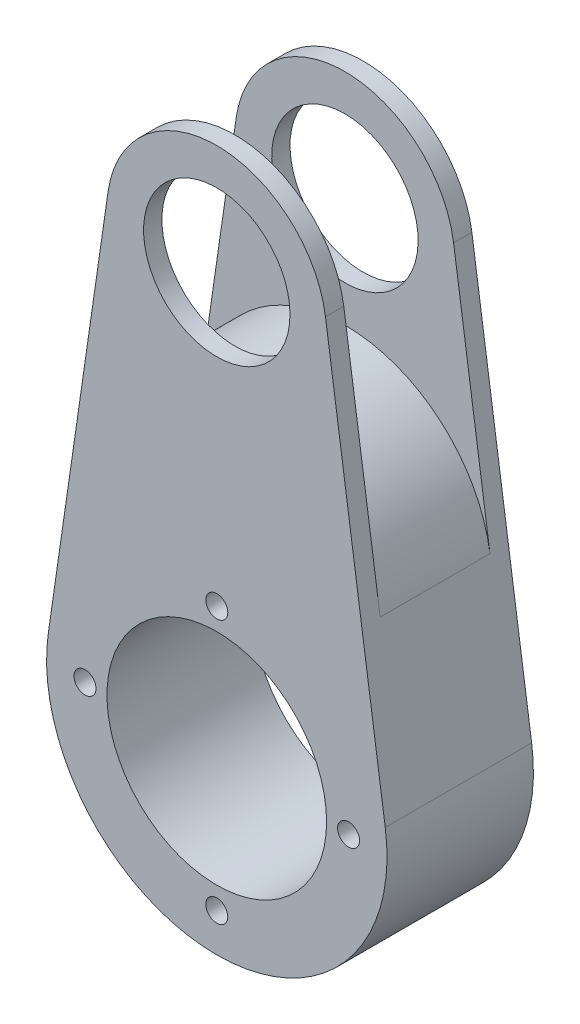
ISO-10303-21;
HEADER;
FILE_DESCRIPTION(('STEP AP214'),'2;1');
FILE_NAME('part.step','',(''),(''),'','','');
FILE_SCHEMA(('AUTOMOTIVE_DESIGN { 1 0 10303 214 1 1 1 1 }'));
ENDSEC;
DATA;
#1=APPLICATION_CONTEXT('core data for automotive mechanical design processes');
#2=APPLICATION_PROTOCOL_DEFINITION('international standard','automotive_design',2000,#1);
#3=PRODUCT_CONTEXT('',#1,'mechanical');
#4=PRODUCT('Part','Part','',(#3));
#5=PRODUCT_RELATED_PRODUCT_CATEGORY('part','',(#4));
#6=PRODUCT_DEFINITION_FORMATION('','',#4);
#7=PRODUCT_DEFINITION_CONTEXT('part definition',#1,'design');
#8=PRODUCT_DEFINITION('design','',#6,#7);
#9=PRODUCT_DEFINITION_SHAPE('','',#8);
#10=(LENGTH_UNIT() NAMED_UNIT(*) SI_UNIT(.MILLI.,.METRE.));
#11=(NAMED_UNIT(*) PLANE_ANGLE_UNIT() SI_UNIT($,.RADIAN.));
#12=(NAMED_UNIT(*) SI_UNIT($,.STERADIAN.) SOLID_ANGLE_UNIT());
#13=UNCERTAINTY_MEASURE_WITH_UNIT(LENGTH_MEASURE(1.E-05),#10,'distance_accuracy_value','');
#14=(GEOMETRIC_REPRESENTATION_CONTEXT(3) GLOBAL_UNCERTAINTY_ASSIGNED_CONTEXT((#13)) GLOBAL_UNIT_ASSIGNED_CONTEXT((#10,
#11,#12)) REPRESENTATION_CONTEXT('',''));
#15=CARTESIAN_POINT('',(0.,0.,0.));
#16=DIRECTION('',(0.,0.,1.));
#17=DIRECTION('',(1.,0.,0.));
#18=AXIS2_PLACEMENT_3D('',#15,#16,#17);
#19=CARTESIAN_POINT('',(0.,58.1620294068383,10.));
#20=DIRECTION('',(0.,0.,-1.));
#21=DIRECTION('',(-1.,0.,0.));
#22=AXIS2_PLACEMENT_3D('',#19,#20,#21);
#23=CYLINDRICAL_SURFACE('',#22,15.);
#24=DIRECTION('',(0.,0.,-1.));
#25=VECTOR('',#24,1.);
#26=CARTESIAN_POINT('',(-14.8448020346523,60.3142033198817,10.));
#27=LINE('',#26,#25);
#28=CARTESIAN_POINT('',(-14.8448020346523,60.3142033198817,-7.49999999999999));
#29=VERTEX_POINT('',#28);
#30=CARTESIAN_POINT('',(-14.8448020346523,60.3142033198817,-10.));
#31=VERTEX_POINT('',#30);
#32=EDGE_CURVE('E138',#29,#31,#27,.T.);
#33=ORIENTED_EDGE('',*,*,#32,.F.);
#34=CARTESIAN_POINT('',(0.,58.1620294068383,-7.49999999999999));
#35=DIRECTION('',(0.,0.,-1.));
#36=DIRECTION('',(0.,1.,0.));
#37=AXIS2_PLACEMENT_3D('',#34,#35,#36);
#38=CIRCLE('',#37,15.);
#39=CARTESIAN_POINT('',(14.8448020346522,60.3142033198817,-7.49999999999999));
#40=VERTEX_POINT('',#39);
#41=EDGE_CURVE('E181',#29,#40,#38,.T.);
#42=ORIENTED_EDGE('',*,*,#41,.T.);
#43=DIRECTION('',(0.,0.,-1.));
#44=VECTOR('',#43,1.);
#45=CARTESIAN_POINT('',(14.8448020346522,60.3142033198817,10.));
#46=LINE('',#45,#44);
#47=CARTESIAN_POINT('',(14.8448020346522,60.3142033198817,-10.));
#48=VERTEX_POINT('',#47);
#49=EDGE_CURVE('E137',#40,#48,#46,.T.);
#50=ORIENTED_EDGE('',*,*,#49,.T.);
#51=CARTESIAN_POINT('',(0.,58.1620294068383,-10.));
#52=DIRECTION('',(0.,0.,1.));
#53=DIRECTION('',(1.,0.,0.));
#54=AXIS2_PLACEMENT_3D('',#51,#52,#53);
#55=CIRCLE('',#54,15.);
#56=EDGE_CURVE('E187',#48,#31,#55,.T.);
#57=ORIENTED_EDGE('',*,*,#56,.T.);
#58=EDGE_LOOP('',(#33,#42,#50,#57));
#59=FACE_BOUND('',#58,.T.);
#60=ADVANCED_FACE('F39',(#59),#23,.T.);
#61=CARTESIAN_POINT('',(0.,58.1620294068383,10.));
#62=DIRECTION('',(0.,0.,-1.));
#63=DIRECTION('',(-1.,0.,0.));
#64=AXIS2_PLACEMENT_3D('',#61,#62,#63);
#65=CYLINDRICAL_SURFACE('',#64,10.);
#66=CARTESIAN_POINT('',(0.,58.1620294068383,-7.49999999999999));
#67=DIRECTION('',(0.,0.,-1.));
#68=DIRECTION('',(0.,1.,0.));
#69=AXIS2_PLACEMENT_3D('',#66,#67,#68);
#70=CIRCLE('',#69,10.);
#71=CARTESIAN_POINT('',(0.,68.1620294068383,-7.49999999999999));
#72=VERTEX_POINT('',#71);
#73=EDGE_CURVE('E152',#72,#72,#70,.T.);
#74=ORIENTED_EDGE('',*,*,#73,.F.);
#75=EDGE_LOOP('',(#74));
#76=FACE_BOUND('',#75,.T.);
#77=CARTESIAN_POINT('',(0.,58.1620294068383,-10.));
#78=DIRECTION('',(0.,0.,1.));
#79=DIRECTION('',(1.,0.,0.));
#80=AXIS2_PLACEMENT_3D('',#77,#78,#79);
#81=CIRCLE('',#80,10.);
#82=CARTESIAN_POINT('',(9.99999999999995,58.1620294068383,-10.));
#83=VERTEX_POINT('',#82);
#84=EDGE_CURVE('E218',#83,#83,#81,.T.);
#85=ORIENTED_EDGE('',*,*,#84,.F.);
#86=EDGE_LOOP('',(#85));
#87=FACE_BOUND('',#86,.T.);
#88=ADVANCED_FACE('F265',(#76,#87),#65,.F.);
#89=CARTESIAN_POINT('',(0.,0.662029406838254,10.));
#90=DIRECTION('',(0.,0.,1.));
#91=DIRECTION('',(1.,0.,0.));
#92=AXIS2_PLACEMENT_3D('',#89,#90,#91);
#93=PLANE('',#92);
#94=CARTESIAN_POINT('',(0.,-17.3379705931617,10.));
#95=DIRECTION('',(0.,0.,1.));
#96=DIRECTION('',(1.,0.,0.));
#97=AXIS2_PLACEMENT_3D('',#94,#95,#96);
#98=CIRCLE('',#97,1.5);
#99=CARTESIAN_POINT('',(1.49999999999995,-17.3379705931617,10.));
#100=VERTEX_POINT('',#99);
#101=EDGE_CURVE('E233',#100,#100,#98,.T.);
#102=ORIENTED_EDGE('',*,*,#101,.F.);
#103=EDGE_LOOP('',(#102));
#104=FACE_BOUND('',#103,.T.);
#105=CARTESIAN_POINT('',(0.,18.6620294068382,10.));
#106=DIRECTION('',(0.,0.,1.));
#107=DIRECTION('',(1.,0.,0.));
#108=AXIS2_PLACEMENT_3D('',#105,#106,#107);
#109=CIRCLE('',#108,1.5);
#110=CARTESIAN_POINT('',(1.49999999999994,18.6620294068382,10.));
#111=VERTEX_POINT('',#110);
#112=EDGE_CURVE('E221',#111,#111,#109,.T.);
#113=ORIENTED_EDGE('',*,*,#112,.F.);
#114=EDGE_LOOP('',(#113));
#115=FACE_BOUND('',#114,.T.);
#116=CARTESIAN_POINT('',(0.,0.662029406838254,10.));
#117=DIRECTION('',(0.,0.,1.));
#118=DIRECTION('',(1.,0.,0.));
#119=AXIS2_PLACEMENT_3D('',#116,#117,#118);
#120=CIRCLE('',#119,15.);
#121=CARTESIAN_POINT('',(14.9999999999999,0.662029406838254,10.));
#122=VERTEX_POINT('',#121);
#123=EDGE_CURVE('E207',#122,#122,#120,.T.);
#124=ORIENTED_EDGE('',*,*,#123,.F.);
#125=EDGE_LOOP('',(#124));
#126=FACE_BOUND('',#125,.T.);
#127=CARTESIAN_POINT('',(0.,0.662029406838254,10.));
#128=DIRECTION('',(0.,0.,1.));
#129=DIRECTION('',(1.,0.,0.));
#130=AXIS2_PLACEMENT_3D('',#127,#128,#129);
#131=CIRCLE('',#130,23.25);
#132=CARTESIAN_POINT('',(-23.009443153711,3.99789897205565,10.));
#133=VERTEX_POINT('',#132);
#134=CARTESIAN_POINT('',(23.0094431537109,3.99789897205565,10.));
#135=VERTEX_POINT('',#134);
#136=EDGE_CURVE('E200',#133,#135,#131,.T.);
#137=ORIENTED_EDGE('',*,*,#136,.T.);
#138=DIRECTION('',(-0.143478260869565,0.989653468976816,0.));
#139=VECTOR('',#138,1.);
#140=CARTESIAN_POINT('',(23.0094431537109,3.99789897205565,10.));
#141=LINE('',#140,#139);
#142=CARTESIAN_POINT('',(14.8448020346522,60.3142033198817,10.));
#143=VERTEX_POINT('',#142);
#144=EDGE_CURVE('E202',#135,#143,#141,.T.);
#145=ORIENTED_EDGE('',*,*,#144,.T.);
#146=CARTESIAN_POINT('',(0.,58.1620294068383,10.));
#147=DIRECTION('',(0.,0.,1.));
#148=DIRECTION('',(1.,0.,0.));
#149=AXIS2_PLACEMENT_3D('',#146,#147,#148);
#150=CIRCLE('',#149,15.);
#151=CARTESIAN_POINT('',(-14.8448020346523,60.3142033198817,10.));
#152=VERTEX_POINT('',#151);
#153=EDGE_CURVE('E209',#143,#152,#150,.T.);
#154=ORIENTED_EDGE('',*,*,#153,.T.);
#155=DIRECTION('',(-0.143478260869565,-0.989653468976816,0.));
#156=VECTOR('',#155,1.);
#157=CARTESIAN_POINT('',(-23.009443153711,3.99789897205565,10.));
#158=LINE('',#157,#156);
#159=EDGE_CURVE('E136',#152,#133,#158,.T.);
#160=ORIENTED_EDGE('',*,*,#159,.T.);
#161=EDGE_LOOP('',(#137,#145,#154,#160));
#162=FACE_BOUND('',#161,.T.);
#163=CARTESIAN_POINT('',(0.,58.1620294068383,10.));
#164=DIRECTION('',(0.,0.,1.));
#165=DIRECTION('',(1.,0.,0.));
#166=AXIS2_PLACEMENT_3D('',#163,#164,#165);
#167=CIRCLE('',#166,10.);
#168=CARTESIAN_POINT('',(9.99999999999995,58.1620294068383,10.));
#169=VERTEX_POINT('',#168);
#170=EDGE_CURVE('E215',#169,#169,#167,.T.);
#171=ORIENTED_EDGE('',*,*,#170,.F.);
#172=EDGE_LOOP('',(#171));
#173=FACE_BOUND('',#172,.T.);
#174=CARTESIAN_POINT('',(17.9999999999999,0.662029406838253,10.));
#175=DIRECTION('',(0.,0.,1.));
#176=DIRECTION('',(1.,0.,0.));
#177=AXIS2_PLACEMENT_3D('',#174,#175,#176);
#178=CIRCLE('',#177,1.5);
#179=CARTESIAN_POINT('',(19.4999999999999,0.662029406838253,10.));
#180=VERTEX_POINT('',#179);
#181=EDGE_CURVE('E227',#180,#180,#178,.T.);
#182=ORIENTED_EDGE('',*,*,#181,.F.);
#183=EDGE_LOOP('',(#182));
#184=FACE_BOUND('',#183,.T.);
#185=CARTESIAN_POINT('',(-18.,0.662029406838253,10.));
#186=DIRECTION('',(0.,0.,1.));
#187=DIRECTION('',(1.,0.,0.));
#188=AXIS2_PLACEMENT_3D('',#185,#186,#187);
#189=CIRCLE('',#188,1.5);
#190=CARTESIAN_POINT('',(-16.5,0.662029406838253,10.));
#191=VERTEX_POINT('',#190);
#192=EDGE_CURVE('E239',#191,#191,#189,.T.);
#193=ORIENTED_EDGE('',*,*,#192,.F.);
#194=EDGE_LOOP('',(#193));
#195=FACE_BOUND('',#194,.T.);
#196=ADVANCED_FACE('F262',(#104,#115,#126,#162,#173,#184,#195),#93,.T.);
#197=CARTESIAN_POINT('',(0.,0.662029406838254,-10.));
#198=DIRECTION('',(0.,0.,1.));
#199=DIRECTION('',(1.,0.,0.));
#200=AXIS2_PLACEMENT_3D('',#197,#198,#199);
#201=PLANE('',#200);
#202=CARTESIAN_POINT('',(0.,0.662029406838254,-10.));
#203=DIRECTION('',(0.,0.,1.));
#204=DIRECTION('',(1.,0.,0.));
#205=AXIS2_PLACEMENT_3D('',#202,#203,#204);
#206=CIRCLE('',#205,23.25);
#207=CARTESIAN_POINT('',(-23.009443153711,3.99789897205565,-10.));
#208=VERTEX_POINT('',#207);
#209=CARTESIAN_POINT('',(23.0094431537109,3.99789897205565,-10.));
#210=VERTEX_POINT('',#209);
#211=EDGE_CURVE('E198',#208,#210,#206,.T.);
#212=ORIENTED_EDGE('',*,*,#211,.F.);
#213=DIRECTION('',(-0.143478260869565,-0.989653468976816,0.));
#214=VECTOR('',#213,1.);
#215=CARTESIAN_POINT('',(-23.009443153711,3.99789897205565,-10.));
#216=LINE('',#215,#214);
#217=EDGE_CURVE('E191',#31,#208,#216,.T.);
#218=ORIENTED_EDGE('',*,*,#217,.F.);
#219=ORIENTED_EDGE('',*,*,#56,.F.);
#220=DIRECTION('',(-0.143478260869565,0.989653468976816,0.));
#221=VECTOR('',#220,1.);
#222=CARTESIAN_POINT('',(23.0094431537109,3.99789897205565,-10.));
#223=LINE('',#222,#221);
#224=EDGE_CURVE('E192',#210,#48,#223,.T.);
#225=ORIENTED_EDGE('',*,*,#224,.F.);
#226=EDGE_LOOP('',(#212,#218,#219,#225));
#227=FACE_BOUND('',#226,.T.);
#228=CARTESIAN_POINT('',(0.,0.662029406838254,-10.));
#229=DIRECTION('',(0.,0.,1.));
#230=DIRECTION('',(1.,0.,0.));
#231=AXIS2_PLACEMENT_3D('',#228,#229,#230);
#232=CIRCLE('',#231,15.);
#233=CARTESIAN_POINT('',(14.9999999999999,0.662029406838254,-10.));
#234=VERTEX_POINT('',#233);
#235=EDGE_CURVE('E212',#234,#234,#232,.T.);
#236=ORIENTED_EDGE('',*,*,#235,.T.);
#237=EDGE_LOOP('',(#236));
#238=FACE_BOUND('',#237,.T.);
#239=ORIENTED_EDGE('',*,*,#84,.T.);
#240=EDGE_LOOP('',(#239));
#241=FACE_BOUND('',#240,.T.);
#242=CARTESIAN_POINT('',(0.,18.6620294068382,-10.));
#243=DIRECTION('',(0.,0.,1.));
#244=DIRECTION('',(1.,0.,0.));
#245=AXIS2_PLACEMENT_3D('',#242,#243,#244);
#246=CIRCLE('',#245,1.5);
#247=CARTESIAN_POINT('',(1.49999999999994,18.6620294068382,-10.));
#248=VERTEX_POINT('',#247);
#249=EDGE_CURVE('E224',#248,#248,#246,.T.);
#250=ORIENTED_EDGE('',*,*,#249,.T.);
#251=EDGE_LOOP('',(#250));
#252=FACE_BOUND('',#251,.T.);
#253=CARTESIAN_POINT('',(17.9999999999999,0.662029406838253,-10.));
#254=DIRECTION('',(0.,0.,1.));
#255=DIRECTION('',(1.,0.,0.));
#256=AXIS2_PLACEMENT_3D('',#253,#254,#255);
#257=CIRCLE('',#256,1.5);
#258=CARTESIAN_POINT('',(19.4999999999999,0.662029406838253,-10.));
#259=VERTEX_POINT('',#258);
#260=EDGE_CURVE('E230',#259,#259,#257,.T.);
#261=ORIENTED_EDGE('',*,*,#260,.T.);
#262=EDGE_LOOP('',(#261));
#263=FACE_BOUND('',#262,.T.);
#264=CARTESIAN_POINT('',(0.,-17.3379705931617,-10.));
#265=DIRECTION('',(0.,0.,1.));
#266=DIRECTION('',(1.,0.,0.));
#267=AXIS2_PLACEMENT_3D('',#264,#265,#266);
#268=CIRCLE('',#267,1.5);
#269=CARTESIAN_POINT('',(1.49999999999995,-17.3379705931617,-10.));
#270=VERTEX_POINT('',#269);
#271=EDGE_CURVE('E236',#270,#270,#268,.T.);
#272=ORIENTED_EDGE('',*,*,#271,.T.);
#273=EDGE_LOOP('',(#272));
#274=FACE_BOUND('',#273,.T.);
#275=CARTESIAN_POINT('',(-18.,0.662029406838253,-10.));
#276=DIRECTION('',(0.,0.,1.));
#277=DIRECTION('',(1.,0.,0.));
#278=AXIS2_PLACEMENT_3D('',#275,#276,#277);
#279=CIRCLE('',#278,1.5);
#280=CARTESIAN_POINT('',(-16.5,0.662029406838253,-10.));
#281=VERTEX_POINT('',#280);
#282=EDGE_CURVE('E242',#281,#281,#279,.T.);
#283=ORIENTED_EDGE('',*,*,#282,.T.);
#284=EDGE_LOOP('',(#283));
#285=FACE_BOUND('',#284,.T.);
#286=ADVANCED_FACE('F195',(#227,#238,#241,#252,#263,#274,#285),#201,.F.);
#287=CARTESIAN_POINT('',(0.,0.662029406838254,10.));
#288=DIRECTION('',(0.,0.,-1.));
#289=DIRECTION('',(-1.,0.,0.));
#290=AXIS2_PLACEMENT_3D('',#287,#288,#289);
#291=CYLINDRICAL_SURFACE('',#290,23.25);
#292=ORIENTED_EDGE('',*,*,#211,.T.);
#293=DIRECTION('',(0.,0.,-1.));
#294=VECTOR('',#293,1.);
#295=CARTESIAN_POINT('',(23.0094431537109,3.99789897205565,10.));
#296=LINE('',#295,#294);
#297=EDGE_CURVE('E145',#135,#210,#296,.T.);
#298=ORIENTED_EDGE('',*,*,#297,.F.);
#299=ORIENTED_EDGE('',*,*,#136,.F.);
#300=DIRECTION('',(0.,0.,-1.));
#301=VECTOR('',#300,1.);
#302=CARTESIAN_POINT('',(-23.009443153711,3.99789897205565,10.));
#303=LINE('',#302,#301);
#304=EDGE_CURVE('E141',#133,#208,#303,.T.);
#305=ORIENTED_EDGE('',*,*,#304,.T.);
#306=EDGE_LOOP('',(#292,#298,#299,#305));
#307=FACE_BOUND('',#306,.T.);
#308=ADVANCED_FACE('F260',(#307),#291,.T.);
#309=CARTESIAN_POINT('',(23.0094431537109,3.99789897205565,10.));
#310=DIRECTION('',(-0.989653468976816,-0.143478260869565,0.));
#311=DIRECTION('',(0.143478260869565,-0.989653468976816,0.));
#312=AXIS2_PLACEMENT_3D('',#309,#310,#311);
#313=PLANE('',#312);
#314=DIRECTION('',(0.,0.,1.));
#315=VECTOR('',#314,1.);
#316=CARTESIAN_POINT('',(19.8150357860778,26.0315946242296,10.));
#317=LINE('',#316,#315);
#318=CARTESIAN_POINT('',(19.8150357860778,26.0315946242296,-7.5));
#319=VERTEX_POINT('',#318);
#320=CARTESIAN_POINT('',(19.8150357860778,26.0315946242296,7.5));
#321=VERTEX_POINT('',#320);
#322=EDGE_CURVE('E148',#319,#321,#317,.T.);
#323=ORIENTED_EDGE('',*,*,#322,.T.);
#324=DIRECTION('',(-0.143478260869565,0.989653468976816,0.));
#325=VECTOR('',#324,1.);
#326=CARTESIAN_POINT('',(23.0094431537109,3.99789897205565,7.5));
#327=LINE('',#326,#325);
#328=CARTESIAN_POINT('',(14.8448020346522,60.3142033198817,7.5));
#329=VERTEX_POINT('',#328);
#330=EDGE_CURVE('E126',#321,#329,#327,.T.);
#331=ORIENTED_EDGE('',*,*,#330,.T.);
#332=EDGE_CURVE('E123',#143,#329,#46,.T.);
#333=ORIENTED_EDGE('',*,*,#332,.F.);
#334=ORIENTED_EDGE('',*,*,#144,.F.);
#335=ORIENTED_EDGE('',*,*,#297,.T.);
#336=ORIENTED_EDGE('',*,*,#224,.T.);
#337=ORIENTED_EDGE('',*,*,#49,.F.);
#338=DIRECTION('',(0.143478260869565,-0.989653468976816,0.));
#339=VECTOR('',#338,1.);
#340=CARTESIAN_POINT('',(23.0094431537109,3.99789897205565,-7.5));
#341=LINE('',#340,#339);
#342=EDGE_CURVE('E245',#40,#319,#341,.T.);
#343=ORIENTED_EDGE('',*,*,#342,.T.);
#344=EDGE_LOOP('',(#323,#331,#333,#334,#335,#336,#337,#343));
#345=FACE_BOUND('',#344,.T.);
#346=ADVANCED_FACE('F256',(#345),#313,.F.);
#347=CARTESIAN_POINT('',(0.,58.1620294068383,7.5));
#348=DIRECTION('',(0.,0.,1.));
#349=DIRECTION('',(1.,0.,0.));
#350=AXIS2_PLACEMENT_3D('',#347,#348,#349);
#351=CIRCLE('',#350,15.);
#352=CARTESIAN_POINT('',(-14.8448020346523,60.3142033198817,7.5));
#353=VERTEX_POINT('',#352);
#354=EDGE_CURVE('E117',#329,#353,#351,.T.);
#355=ORIENTED_EDGE('',*,*,#354,.T.);
#356=EDGE_CURVE('E120',#152,#353,#27,.T.);
#357=ORIENTED_EDGE('',*,*,#356,.F.);
#358=ORIENTED_EDGE('',*,*,#153,.F.);
#359=ORIENTED_EDGE('',*,*,#332,.T.);
#360=EDGE_LOOP('',(#355,#357,#358,#359));
#361=FACE_BOUND('',#360,.T.);
#362=ADVANCED_FACE('F118',(#361),#23,.T.);
#363=CARTESIAN_POINT('',(-23.009443153711,3.99789897205565,10.));
#364=DIRECTION('',(0.989653468976816,-0.143478260869565,0.));
#365=DIRECTION('',(0.143478260869565,0.989653468976816,0.));
#366=AXIS2_PLACEMENT_3D('',#363,#364,#365);
#367=PLANE('',#366);
#368=DIRECTION('',(0.,0.,-1.));
#369=VECTOR('',#368,1.);
#370=CARTESIAN_POINT('',(-19.8150357860779,26.0315946242296,10.));
#371=LINE('',#370,#369);
#372=CARTESIAN_POINT('',(-19.8150357860779,26.0315946242296,7.5));
#373=VERTEX_POINT('',#372);
#374=CARTESIAN_POINT('',(-19.8150357860779,26.0315946242296,-7.5));
#375=VERTEX_POINT('',#374);
#376=EDGE_CURVE('E161',#373,#375,#371,.T.);
#377=ORIENTED_EDGE('',*,*,#376,.T.);
#378=DIRECTION('',(0.143478260869565,0.989653468976816,0.));
#379=VECTOR('',#378,1.);
#380=CARTESIAN_POINT('',(-23.009443153711,3.99789897205565,-7.5));
#381=LINE('',#380,#379);
#382=EDGE_CURVE('E54',#375,#29,#381,.T.);
#383=ORIENTED_EDGE('',*,*,#382,.T.);
#384=ORIENTED_EDGE('',*,*,#32,.T.);
#385=ORIENTED_EDGE('',*,*,#217,.T.);
#386=ORIENTED_EDGE('',*,*,#304,.F.);
#387=ORIENTED_EDGE('',*,*,#159,.F.);
#388=ORIENTED_EDGE('',*,*,#356,.T.);
#389=DIRECTION('',(-0.143478260869565,-0.989653468976816,0.));
#390=VECTOR('',#389,1.);
#391=CARTESIAN_POINT('',(-23.009443153711,3.99789897205565,7.5));
#392=LINE('',#391,#390);
#393=EDGE_CURVE('E62',#353,#373,#392,.T.);
#394=ORIENTED_EDGE('',*,*,#393,.T.);
#395=EDGE_LOOP('',(#377,#383,#384,#385,#386,#387,#388,#394));
#396=FACE_BOUND('',#395,.T.);
#397=ADVANCED_FACE('F134',(#396),#367,.F.);
#398=CARTESIAN_POINT('',(0.,0.662029406838254,10.));
#399=DIRECTION('',(0.,0.,-1.));
#400=DIRECTION('',(-1.,0.,0.));
#401=AXIS2_PLACEMENT_3D('',#398,#399,#400);
#402=CYLINDRICAL_SURFACE('',#401,15.);
#403=ORIENTED_EDGE('',*,*,#123,.T.);
#404=EDGE_LOOP('',(#403));
#405=FACE_BOUND('',#404,.T.);
#406=ORIENTED_EDGE('',*,*,#235,.F.);
#407=EDGE_LOOP('',(#406));
#408=FACE_BOUND('',#407,.T.);
#409=ADVANCED_FACE('F302',(#405,#408),#402,.F.);
#410=CARTESIAN_POINT('',(0.,58.1620294068383,7.5));
#411=DIRECTION('',(0.,0.,1.));
#412=DIRECTION('',(1.,0.,0.));
#413=AXIS2_PLACEMENT_3D('',#410,#411,#412);
#414=CIRCLE('',#413,10.);
#415=CARTESIAN_POINT('',(9.99999999999995,58.1620294068383,7.5));
#416=VERTEX_POINT('',#415);
#417=EDGE_CURVE('E132',#416,#416,#414,.T.);
#418=ORIENTED_EDGE('',*,*,#417,.F.);
#419=EDGE_LOOP('',(#418));
#420=FACE_BOUND('',#419,.T.);
#421=ORIENTED_EDGE('',*,*,#170,.T.);
#422=EDGE_LOOP('',(#421));
#423=FACE_BOUND('',#422,.T.);
#424=ADVANCED_FACE('F295',(#420,#423),#65,.F.);
#425=CARTESIAN_POINT('',(0.,18.6620294068382,10.));
#426=DIRECTION('',(0.,0.,-1.));
#427=DIRECTION('',(-1.,0.,0.));
#428=AXIS2_PLACEMENT_3D('',#425,#426,#427);
#429=CYLINDRICAL_SURFACE('',#428,1.5);
#430=ORIENTED_EDGE('',*,*,#112,.T.);
#431=EDGE_LOOP('',(#430));
#432=FACE_BOUND('',#431,.T.);
#433=ORIENTED_EDGE('',*,*,#249,.F.);
#434=EDGE_LOOP('',(#433));
#435=FACE_BOUND('',#434,.T.);
#436=ADVANCED_FACE('F326',(#432,#435),#429,.F.);
#437=CARTESIAN_POINT('',(17.9999999999999,0.662029406838253,10.));
#438=DIRECTION('',(0.,0.,-1.));
#439=DIRECTION('',(-1.,0.,0.));
#440=AXIS2_PLACEMENT_3D('',#437,#438,#439);
#441=CYLINDRICAL_SURFACE('',#440,1.5);
#442=ORIENTED_EDGE('',*,*,#181,.T.);
#443=EDGE_LOOP('',(#442));
#444=FACE_BOUND('',#443,.T.);
#445=ORIENTED_EDGE('',*,*,#260,.F.);
#446=EDGE_LOOP('',(#445));
#447=FACE_BOUND('',#446,.T.);
#448=ADVANCED_FACE('F322',(#444,#447),#441,.F.);
#449=CARTESIAN_POINT('',(0.,-17.3379705931617,10.));
#450=DIRECTION('',(0.,0.,-1.));
#451=DIRECTION('',(-1.,0.,0.));
#452=AXIS2_PLACEMENT_3D('',#449,#450,#451);
#453=CYLINDRICAL_SURFACE('',#452,1.5);
#454=ORIENTED_EDGE('',*,*,#101,.T.);
#455=EDGE_LOOP('',(#454));
#456=FACE_BOUND('',#455,.T.);
#457=ORIENTED_EDGE('',*,*,#271,.F.);
#458=EDGE_LOOP('',(#457));
#459=FACE_BOUND('',#458,.T.);
#460=ADVANCED_FACE('F277',(#456,#459),#453,.F.);
#461=CARTESIAN_POINT('',(-18.,0.662029406838253,10.));
#462=DIRECTION('',(0.,0.,-1.));
#463=DIRECTION('',(-1.,0.,0.));
#464=AXIS2_PLACEMENT_3D('',#461,#462,#463);
#465=CYLINDRICAL_SURFACE('',#464,1.5);
#466=ORIENTED_EDGE('',*,*,#192,.T.);
#467=EDGE_LOOP('',(#466));
#468=FACE_BOUND('',#467,.T.);
#469=ORIENTED_EDGE('',*,*,#282,.F.);
#470=EDGE_LOOP('',(#469));
#471=FACE_BOUND('',#470,.T.);
#472=ADVANCED_FACE('F274',(#468,#471),#465,.F.);
#473=CARTESIAN_POINT('',(-23.2500000000001,43.1620294068383,-7.5));
#474=DIRECTION('',(0.,-1.,0.));
#475=DIRECTION('',(0.,0.,-1.));
#476=AXIS2_PLACEMENT_3D('',#473,#474,#475);
#477=PLANE('',#476);
#478=DIRECTION('',(1.,0.,0.));
#479=VECTOR('',#478,1.);
#480=CARTESIAN_POINT('',(-23.2500000000001,43.1620294068383,7.5));
#481=LINE('',#480,#479);
#482=CARTESIAN_POINT('',(-0.0219664065415869,43.1620294068383,7.5));
#483=VERTEX_POINT('',#482);
#484=CARTESIAN_POINT('',(0.0219664065414758,43.1620294068383,7.5));
#485=VERTEX_POINT('',#484);
#486=EDGE_CURVE('E177',#483,#485,#481,.T.);
#487=ORIENTED_EDGE('',*,*,#486,.T.);
#488=DIRECTION('',(0.,0.,1.));
#489=VECTOR('',#488,1.);
#490=CARTESIAN_POINT('',(0.0219664065414758,43.1620294068383,-7.5));
#491=LINE('',#490,#489);
#492=CARTESIAN_POINT('',(0.0219664065414758,43.1620294068383,-7.5));
#493=VERTEX_POINT('',#492);
#494=EDGE_CURVE('E159',#485,#493,#491,.F.);
#495=ORIENTED_EDGE('',*,*,#494,.T.);
#496=DIRECTION('',(1.,0.,0.));
#497=VECTOR('',#496,1.);
#498=CARTESIAN_POINT('',(-23.2500000000001,43.1620294068383,-7.5));
#499=LINE('',#498,#497);
#500=CARTESIAN_POINT('',(-0.0219664065415869,43.1620294068383,-7.5));
#501=VERTEX_POINT('',#500);
#502=EDGE_CURVE('E151',#501,#493,#499,.T.);
#503=ORIENTED_EDGE('',*,*,#502,.F.);
#504=DIRECTION('',(0.,0.,-1.));
#505=VECTOR('',#504,1.);
#506=CARTESIAN_POINT('',(-0.0219664065415869,43.1620294068383,-7.5));
#507=LINE('',#506,#505);
#508=EDGE_CURVE('E157',#501,#483,#507,.F.);
#509=ORIENTED_EDGE('',*,*,#508,.T.);
#510=EDGE_LOOP('',(#487,#495,#503,#509));
#511=FACE_BOUND('',#510,.T.);
#512=ADVANCED_FACE('F175',(#511),#477,.F.);
#513=CARTESIAN_POINT('',(-23.2500000000001,73.1620294068382,-7.5));
#514=DIRECTION('',(0.,0.,-1.));
#515=DIRECTION('',(0.,1.,0.));
#516=AXIS2_PLACEMENT_3D('',#513,#514,#515);
#517=PLANE('',#516);
#518=ORIENTED_EDGE('',*,*,#73,.T.);
#519=EDGE_LOOP('',(#518));
#520=FACE_BOUND('',#519,.T.);
#521=ORIENTED_EDGE('',*,*,#41,.F.);
#522=ORIENTED_EDGE('',*,*,#382,.F.);
#523=CARTESIAN_POINT('',(-0.021966406541586,23.1620294068383,-7.5));
#524=DIRECTION('',(0.,0.,-1.));
#525=DIRECTION('',(0.,1.,0.));
#526=AXIS2_PLACEMENT_3D('',#523,#524,#525);
#527=CIRCLE('',#526,20.);
#528=EDGE_CURVE('E47',#375,#501,#527,.T.);
#529=ORIENTED_EDGE('',*,*,#528,.T.);
#530=ORIENTED_EDGE('',*,*,#502,.T.);
#531=CARTESIAN_POINT('',(0.021966406541475,23.1620294068383,-7.5));
#532=DIRECTION('',(0.,0.,-1.));
#533=DIRECTION('',(0.,1.,0.));
#534=AXIS2_PLACEMENT_3D('',#531,#532,#533);
#535=CIRCLE('',#534,20.);
#536=EDGE_CURVE('E165',#493,#319,#535,.T.);
#537=ORIENTED_EDGE('',*,*,#536,.T.);
#538=ORIENTED_EDGE('',*,*,#342,.F.);
#539=EDGE_LOOP('',(#521,#522,#529,#530,#537,#538));
#540=FACE_BOUND('',#539,.T.);
#541=ADVANCED_FACE('F169',(#520,#540),#517,.F.);
#542=CARTESIAN_POINT('',(-23.2500000000001,43.1620294068383,7.5));
#543=DIRECTION('',(0.,0.,1.));
#544=DIRECTION('',(1.,0.,0.));
#545=AXIS2_PLACEMENT_3D('',#542,#543,#544);
#546=PLANE('',#545);
#547=ORIENTED_EDGE('',*,*,#417,.T.);
#548=EDGE_LOOP('',(#547));
#549=FACE_BOUND('',#548,.T.);
#550=ORIENTED_EDGE('',*,*,#486,.F.);
#551=CARTESIAN_POINT('',(-0.021966406541586,23.1620294068383,7.5));
#552=DIRECTION('',(0.,0.,1.));
#553=DIRECTION('',(1.,0.,0.));
#554=AXIS2_PLACEMENT_3D('',#551,#552,#553);
#555=CIRCLE('',#554,20.);
#556=EDGE_CURVE('E11',#483,#373,#555,.T.);
#557=ORIENTED_EDGE('',*,*,#556,.T.);
#558=ORIENTED_EDGE('',*,*,#393,.F.);
#559=ORIENTED_EDGE('',*,*,#354,.F.);
#560=ORIENTED_EDGE('',*,*,#330,.F.);
#561=CARTESIAN_POINT('',(0.021966406541475,23.1620294068383,7.5));
#562=DIRECTION('',(0.,0.,1.));
#563=DIRECTION('',(1.,0.,0.));
#564=AXIS2_PLACEMENT_3D('',#561,#562,#563);
#565=CIRCLE('',#564,20.);
#566=EDGE_CURVE('E163',#321,#485,#565,.T.);
#567=ORIENTED_EDGE('',*,*,#566,.T.);
#568=EDGE_LOOP('',(#550,#557,#558,#559,#560,#567));
#569=FACE_BOUND('',#568,.T.);
#570=ADVANCED_FACE('F129',(#549,#569),#546,.F.);
#571=CARTESIAN_POINT('',(0.021966406541475,23.1620294068383,10.));
#572=DIRECTION('',(0.,0.,1.));
#573=DIRECTION('',(1.,0.,0.));
#574=AXIS2_PLACEMENT_3D('',#571,#572,#573);
#575=CYLINDRICAL_SURFACE('',#574,20.);
#576=ORIENTED_EDGE('',*,*,#536,.F.);
#577=ORIENTED_EDGE('',*,*,#494,.F.);
#578=ORIENTED_EDGE('',*,*,#566,.F.);
#579=ORIENTED_EDGE('',*,*,#322,.F.);
#580=EDGE_LOOP('',(#576,#577,#578,#579));
#581=FACE_BOUND('',#580,.T.);
#582=ADVANCED_FACE('F253',(#581),#575,.T.);
#583=CARTESIAN_POINT('',(-0.021966406541586,23.1620294068383,10.));
#584=DIRECTION('',(0.,0.,-1.));
#585=DIRECTION('',(-1.,0.,0.));
#586=AXIS2_PLACEMENT_3D('',#583,#584,#585);
#587=CYLINDRICAL_SURFACE('',#586,20.);
#588=ORIENTED_EDGE('',*,*,#556,.F.);
#589=ORIENTED_EDGE('',*,*,#508,.F.);
#590=ORIENTED_EDGE('',*,*,#528,.F.);
#591=ORIENTED_EDGE('',*,*,#376,.F.);
#592=EDGE_LOOP('',(#588,#589,#590,#591));
#593=FACE_BOUND('',#592,.T.);
#594=ADVANCED_FACE('F41',(#593),#587,.T.);
#595=CLOSED_SHELL('',(#60,#88,#196,#286,#308,#346,#362,#397,#409,#424,#436,#448,#460,#472,#512,
#541,#570,#582,#594));
#596=MANIFOLD_SOLID_BREP('B2',#595);
#597=ADVANCED_BREP_SHAPE_REPRESENTATION('',(#18,#596),#14);
#598=SHAPE_DEFINITION_REPRESENTATION(#9,#597);
ENDSEC;
END-ISO-10303-21;
